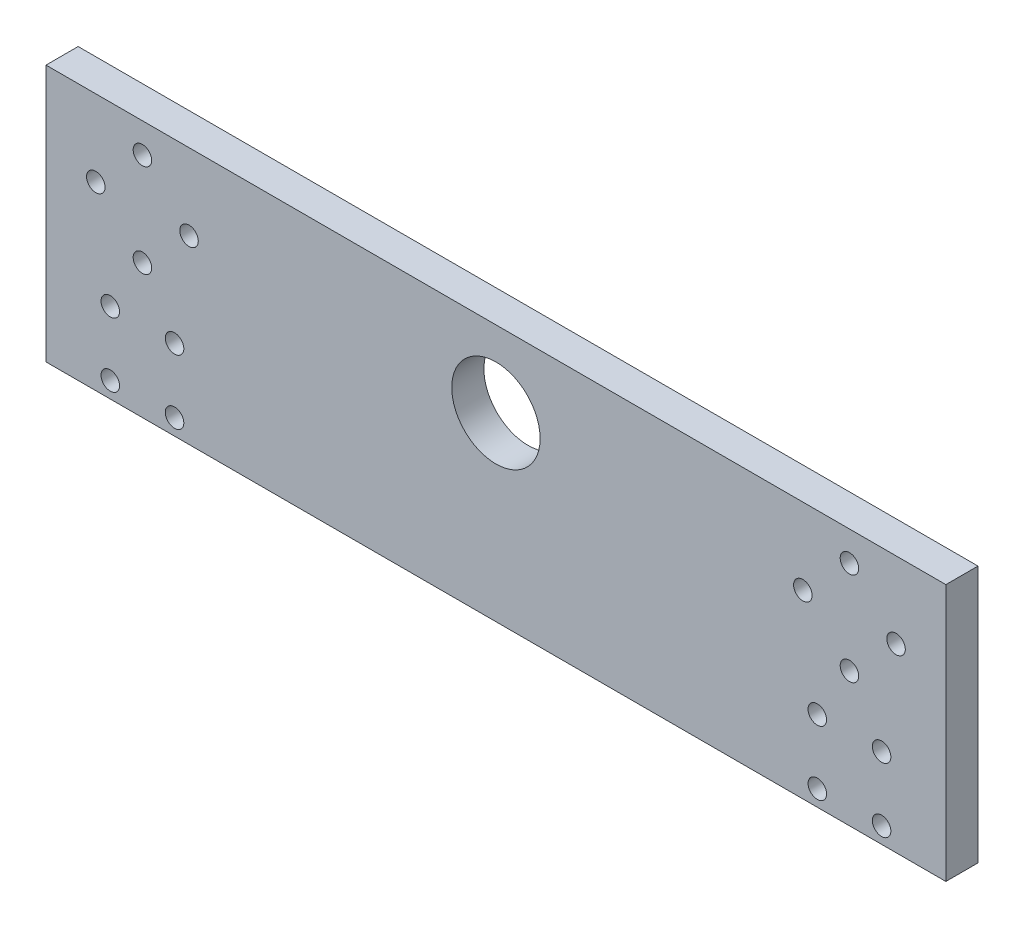
ISO-10303-21;
HEADER;
FILE_DESCRIPTION(('STEP AP214'),'2;1');
FILE_NAME('part.step','',(''),(''),'','','');
FILE_SCHEMA(('AUTOMOTIVE_DESIGN { 1 0 10303 214 1 1 1 1 }'));
ENDSEC;
DATA;
#1=APPLICATION_CONTEXT('core data for automotive mechanical design processes');
#2=APPLICATION_PROTOCOL_DEFINITION('international standard','automotive_design',2000,#1);
#3=PRODUCT_CONTEXT('',#1,'mechanical');
#4=PRODUCT('Part','Part','',(#3));
#5=PRODUCT_RELATED_PRODUCT_CATEGORY('part','',(#4));
#6=PRODUCT_DEFINITION_FORMATION('','',#4);
#7=PRODUCT_DEFINITION_CONTEXT('part definition',#1,'design');
#8=PRODUCT_DEFINITION('design','',#6,#7);
#9=PRODUCT_DEFINITION_SHAPE('','',#8);
#10=(LENGTH_UNIT() NAMED_UNIT(*) SI_UNIT(.MILLI.,.METRE.));
#11=(NAMED_UNIT(*) PLANE_ANGLE_UNIT() SI_UNIT($,.RADIAN.));
#12=(NAMED_UNIT(*) SI_UNIT($,.STERADIAN.) SOLID_ANGLE_UNIT());
#13=UNCERTAINTY_MEASURE_WITH_UNIT(LENGTH_MEASURE(1.E-05),#10,'distance_accuracy_value','');
#14=(GEOMETRIC_REPRESENTATION_CONTEXT(3) GLOBAL_UNCERTAINTY_ASSIGNED_CONTEXT((#13)) GLOBAL_UNIT_ASSIGNED_CONTEXT((#10,
#11,#12)) REPRESENTATION_CONTEXT('',''));
#15=CARTESIAN_POINT('',(0.,0.,0.));
#16=DIRECTION('',(0.,0.,1.));
#17=DIRECTION('',(1.,0.,0.));
#18=AXIS2_PLACEMENT_3D('',#15,#16,#17);
#19=CARTESIAN_POINT('',(0.,0.,6.35));
#20=DIRECTION('',(0.,0.,1.));
#21=DIRECTION('',(1.,0.,0.));
#22=AXIS2_PLACEMENT_3D('',#19,#20,#21);
#23=PLANE('',#22);
#24=CARTESIAN_POINT('',(76.2,-32.54375,6.35));
#25=DIRECTION('',(0.,0.,1.));
#26=DIRECTION('',(1.,0.,0.));
#27=AXIS2_PLACEMENT_3D('',#24,#25,#26);
#28=CIRCLE('',#27,1.8288);
#29=CARTESIAN_POINT('',(78.0288,-32.54375,6.35));
#30=VERTEX_POINT('',#29);
#31=EDGE_CURVE('E198',#30,#30,#28,.T.);
#32=ORIENTED_EDGE('',*,*,#31,.F.);
#33=EDGE_LOOP('',(#32));
#34=FACE_BOUND('',#33,.T.);
#35=CARTESIAN_POINT('',(63.5,-19.84375,6.35));
#36=DIRECTION('',(0.,0.,1.));
#37=DIRECTION('',(1.,0.,0.));
#38=AXIS2_PLACEMENT_3D('',#35,#36,#37);
#39=CIRCLE('',#38,1.8288);
#40=CARTESIAN_POINT('',(65.3288,-19.84375,6.35));
#41=VERTEX_POINT('',#40);
#42=EDGE_CURVE('E186',#41,#41,#39,.T.);
#43=ORIENTED_EDGE('',*,*,#42,.F.);
#44=EDGE_LOOP('',(#43));
#45=FACE_BOUND('',#44,.T.);
#46=CARTESIAN_POINT('',(-63.5,-32.54375,6.35));
#47=DIRECTION('',(0.,0.,1.));
#48=DIRECTION('',(1.,0.,0.));
#49=AXIS2_PLACEMENT_3D('',#46,#47,#48);
#50=CIRCLE('',#49,1.8288);
#51=CARTESIAN_POINT('',(-61.6712,-32.54375,6.35));
#52=VERTEX_POINT('',#51);
#53=EDGE_CURVE('E174',#52,#52,#50,.T.);
#54=ORIENTED_EDGE('',*,*,#53,.F.);
#55=EDGE_LOOP('',(#54));
#56=FACE_BOUND('',#55,.T.);
#57=CARTESIAN_POINT('',(-76.2,-19.84375,6.35));
#58=DIRECTION('',(0.,0.,1.));
#59=DIRECTION('',(1.,0.,0.));
#60=AXIS2_PLACEMENT_3D('',#57,#58,#59);
#61=CIRCLE('',#60,1.8288);
#62=CARTESIAN_POINT('',(-74.3712,-19.84375,6.35));
#63=VERTEX_POINT('',#62);
#64=EDGE_CURVE('E162',#63,#63,#61,.T.);
#65=ORIENTED_EDGE('',*,*,#64,.F.);
#66=EDGE_LOOP('',(#65));
#67=FACE_BOUND('',#66,.T.);
#68=CARTESIAN_POINT('',(-69.85,9.20749999999997,6.35));
#69=DIRECTION('',(0.,0.,1.));
#70=DIRECTION('',(1.,0.,0.));
#71=AXIS2_PLACEMENT_3D('',#68,#69,#70);
#72=CIRCLE('',#71,1.82879999999987);
#73=CARTESIAN_POINT('',(-68.0212000000001,9.20749999999997,6.35));
#74=VERTEX_POINT('',#73);
#75=EDGE_CURVE('E150',#74,#74,#72,.T.);
#76=ORIENTED_EDGE('',*,*,#75,.F.);
#77=EDGE_LOOP('',(#76));
#78=FACE_BOUND('',#77,.T.);
#79=CARTESIAN_POINT('',(79.0575,0.,6.35));
#80=DIRECTION('',(0.,0.,1.));
#81=DIRECTION('',(1.,0.,0.));
#82=AXIS2_PLACEMENT_3D('',#79,#80,#81);
#83=CIRCLE('',#82,1.82879999999998);
#84=CARTESIAN_POINT('',(80.8863,0.,6.35));
#85=VERTEX_POINT('',#84);
#86=EDGE_CURVE('E138',#85,#85,#83,.T.);
#87=ORIENTED_EDGE('',*,*,#86,.F.);
#88=EDGE_LOOP('',(#87));
#89=FACE_BOUND('',#88,.T.);
#90=CARTESIAN_POINT('',(60.6425,0.,6.35));
#91=DIRECTION('',(0.,0.,1.));
#92=DIRECTION('',(1.,0.,0.));
#93=AXIS2_PLACEMENT_3D('',#90,#91,#92);
#94=CIRCLE('',#93,1.8288);
#95=CARTESIAN_POINT('',(62.4713,0.,6.35));
#96=VERTEX_POINT('',#95);
#97=EDGE_CURVE('E126',#96,#96,#94,.T.);
#98=ORIENTED_EDGE('',*,*,#97,.F.);
#99=EDGE_LOOP('',(#98));
#100=FACE_BOUND('',#99,.T.);
#101=CARTESIAN_POINT('',(-79.0575,0.,6.35));
#102=DIRECTION('',(0.,0.,1.));
#103=DIRECTION('',(1.,0.,0.));
#104=AXIS2_PLACEMENT_3D('',#101,#102,#103);
#105=CIRCLE('',#104,1.8288);
#106=CARTESIAN_POINT('',(-77.2287,0.,6.35));
#107=VERTEX_POINT('',#106);
#108=EDGE_CURVE('E114',#107,#107,#105,.T.);
#109=ORIENTED_EDGE('',*,*,#108,.F.);
#110=EDGE_LOOP('',(#109));
#111=FACE_BOUND('',#110,.T.);
#112=DIRECTION('',(0.,-1.,0.));
#113=VECTOR('',#112,1.);
#114=CARTESIAN_POINT('',(-88.9,15.08125,6.35));
#115=LINE('',#114,#113);
#116=CARTESIAN_POINT('',(-88.9,15.08125,6.35));
#117=VERTEX_POINT('',#116);
#118=CARTESIAN_POINT('',(-88.9,-35.71875,6.35));
#119=VERTEX_POINT('',#118);
#120=EDGE_CURVE('E84',#117,#119,#115,.T.);
#121=ORIENTED_EDGE('',*,*,#120,.T.);
#122=DIRECTION('',(1.,0.,0.));
#123=VECTOR('',#122,1.);
#124=CARTESIAN_POINT('',(-88.9,-35.71875,6.35));
#125=LINE('',#124,#123);
#126=CARTESIAN_POINT('',(88.9,-35.71875,6.35));
#127=VERTEX_POINT('',#126);
#128=EDGE_CURVE('E79',#119,#127,#125,.T.);
#129=ORIENTED_EDGE('',*,*,#128,.T.);
#130=DIRECTION('',(0.,1.,0.));
#131=VECTOR('',#130,1.);
#132=CARTESIAN_POINT('',(88.9,15.08125,6.35));
#133=LINE('',#132,#131);
#134=CARTESIAN_POINT('',(88.9,15.08125,6.35));
#135=VERTEX_POINT('',#134);
#136=EDGE_CURVE('E82',#127,#135,#133,.T.);
#137=ORIENTED_EDGE('',*,*,#136,.T.);
#138=DIRECTION('',(-1.,0.,0.));
#139=VECTOR('',#138,1.);
#140=CARTESIAN_POINT('',(-88.9,15.08125,6.35));
#141=LINE('',#140,#139);
#142=EDGE_CURVE('E49',#135,#117,#141,.T.);
#143=ORIENTED_EDGE('',*,*,#142,.T.);
#144=EDGE_LOOP('',(#121,#129,#137,#143));
#145=FACE_BOUND('',#144,.T.);
#146=CARTESIAN_POINT('',(0.,0.,6.35));
#147=DIRECTION('',(0.,0.,1.));
#148=DIRECTION('',(1.,0.,0.));
#149=AXIS2_PLACEMENT_3D('',#146,#147,#148);
#150=CIRCLE('',#149,8.73125);
#151=CARTESIAN_POINT('',(8.73125,0.,6.35));
#152=VERTEX_POINT('',#151);
#153=EDGE_CURVE('E99',#152,#152,#150,.T.);
#154=ORIENTED_EDGE('',*,*,#153,.F.);
#155=EDGE_LOOP('',(#154));
#156=FACE_BOUND('',#155,.T.);
#157=CARTESIAN_POINT('',(-60.6425,0.,6.35));
#158=DIRECTION('',(0.,0.,1.));
#159=DIRECTION('',(1.,0.,0.));
#160=AXIS2_PLACEMENT_3D('',#157,#158,#159);
#161=CIRCLE('',#160,1.82880000000001);
#162=CARTESIAN_POINT('',(-58.8137,0.,6.35));
#163=VERTEX_POINT('',#162);
#164=EDGE_CURVE('E120',#163,#163,#161,.T.);
#165=ORIENTED_EDGE('',*,*,#164,.F.);
#166=EDGE_LOOP('',(#165));
#167=FACE_BOUND('',#166,.T.);
#168=CARTESIAN_POINT('',(69.8499999999999,9.2075,6.35));
#169=DIRECTION('',(0.,0.,1.));
#170=DIRECTION('',(1.,0.,0.));
#171=AXIS2_PLACEMENT_3D('',#168,#169,#170);
#172=CIRCLE('',#171,1.82879999999998);
#173=CARTESIAN_POINT('',(71.6787999999999,9.2075,6.35));
#174=VERTEX_POINT('',#173);
#175=EDGE_CURVE('E132',#174,#174,#172,.T.);
#176=ORIENTED_EDGE('',*,*,#175,.F.);
#177=EDGE_LOOP('',(#176));
#178=FACE_BOUND('',#177,.T.);
#179=CARTESIAN_POINT('',(69.85,-9.2075,6.35));
#180=DIRECTION('',(0.,0.,1.));
#181=DIRECTION('',(1.,0.,0.));
#182=AXIS2_PLACEMENT_3D('',#179,#180,#181);
#183=CIRCLE('',#182,1.82879999999998);
#184=CARTESIAN_POINT('',(71.6788,-9.2075,6.35));
#185=VERTEX_POINT('',#184);
#186=EDGE_CURVE('E144',#185,#185,#183,.T.);
#187=ORIENTED_EDGE('',*,*,#186,.F.);
#188=EDGE_LOOP('',(#187));
#189=FACE_BOUND('',#188,.T.);
#190=CARTESIAN_POINT('',(-69.85,-9.20750000000004,6.35));
#191=DIRECTION('',(0.,0.,1.));
#192=DIRECTION('',(1.,0.,0.));
#193=AXIS2_PLACEMENT_3D('',#190,#191,#192);
#194=CIRCLE('',#193,1.82880000000006);
#195=CARTESIAN_POINT('',(-68.0212,-9.20750000000004,6.35));
#196=VERTEX_POINT('',#195);
#197=EDGE_CURVE('E156',#196,#196,#194,.T.);
#198=ORIENTED_EDGE('',*,*,#197,.F.);
#199=EDGE_LOOP('',(#198));
#200=FACE_BOUND('',#199,.T.);
#201=CARTESIAN_POINT('',(-63.5,-19.84375,6.35));
#202=DIRECTION('',(0.,0.,1.));
#203=DIRECTION('',(1.,0.,0.));
#204=AXIS2_PLACEMENT_3D('',#201,#202,#203);
#205=CIRCLE('',#204,1.8288);
#206=CARTESIAN_POINT('',(-61.6712,-19.84375,6.35));
#207=VERTEX_POINT('',#206);
#208=EDGE_CURVE('E168',#207,#207,#205,.T.);
#209=ORIENTED_EDGE('',*,*,#208,.F.);
#210=EDGE_LOOP('',(#209));
#211=FACE_BOUND('',#210,.T.);
#212=CARTESIAN_POINT('',(-76.2,-32.54375,6.35));
#213=DIRECTION('',(0.,0.,1.));
#214=DIRECTION('',(1.,0.,0.));
#215=AXIS2_PLACEMENT_3D('',#212,#213,#214);
#216=CIRCLE('',#215,1.8288);
#217=CARTESIAN_POINT('',(-74.3712,-32.54375,6.35));
#218=VERTEX_POINT('',#217);
#219=EDGE_CURVE('E180',#218,#218,#216,.T.);
#220=ORIENTED_EDGE('',*,*,#219,.F.);
#221=EDGE_LOOP('',(#220));
#222=FACE_BOUND('',#221,.T.);
#223=CARTESIAN_POINT('',(76.2,-19.84375,6.35));
#224=DIRECTION('',(0.,0.,1.));
#225=DIRECTION('',(1.,0.,0.));
#226=AXIS2_PLACEMENT_3D('',#223,#224,#225);
#227=CIRCLE('',#226,1.8288);
#228=CARTESIAN_POINT('',(78.0288,-19.84375,6.35));
#229=VERTEX_POINT('',#228);
#230=EDGE_CURVE('E192',#229,#229,#227,.T.);
#231=ORIENTED_EDGE('',*,*,#230,.F.);
#232=EDGE_LOOP('',(#231));
#233=FACE_BOUND('',#232,.T.);
#234=CARTESIAN_POINT('',(63.5,-32.54375,6.35));
#235=DIRECTION('',(0.,0.,1.));
#236=DIRECTION('',(1.,0.,0.));
#237=AXIS2_PLACEMENT_3D('',#234,#235,#236);
#238=CIRCLE('',#237,1.8288);
#239=CARTESIAN_POINT('',(65.3288,-32.54375,6.35));
#240=VERTEX_POINT('',#239);
#241=EDGE_CURVE('E204',#240,#240,#238,.T.);
#242=ORIENTED_EDGE('',*,*,#241,.F.);
#243=EDGE_LOOP('',(#242));
#244=FACE_BOUND('',#243,.T.);
#245=ADVANCED_FACE('F32',(#34,#45,#56,#67,#78,#89,#100,#111,#145,#156,#167,#178,#189,#200,#211,
#222,#233,#244),#23,.T.);
#246=CARTESIAN_POINT('',(0.,0.,0.));
#247=DIRECTION('',(0.,0.,1.));
#248=DIRECTION('',(1.,0.,0.));
#249=AXIS2_PLACEMENT_3D('',#246,#247,#248);
#250=PLANE('',#249);
#251=DIRECTION('',(0.,-1.,0.));
#252=VECTOR('',#251,1.);
#253=CARTESIAN_POINT('',(-88.9,15.08125,0.));
#254=LINE('',#253,#252);
#255=CARTESIAN_POINT('',(-88.9,15.08125,0.));
#256=VERTEX_POINT('',#255);
#257=CARTESIAN_POINT('',(-88.9,-35.71875,0.));
#258=VERTEX_POINT('',#257);
#259=EDGE_CURVE('E96',#256,#258,#254,.T.);
#260=ORIENTED_EDGE('',*,*,#259,.F.);
#261=DIRECTION('',(-1.,0.,0.));
#262=VECTOR('',#261,1.);
#263=CARTESIAN_POINT('',(-88.9,15.08125,0.));
#264=LINE('',#263,#262);
#265=CARTESIAN_POINT('',(88.9,15.08125,0.));
#266=VERTEX_POINT('',#265);
#267=EDGE_CURVE('E72',#266,#256,#264,.T.);
#268=ORIENTED_EDGE('',*,*,#267,.F.);
#269=DIRECTION('',(0.,1.,0.));
#270=VECTOR('',#269,1.);
#271=CARTESIAN_POINT('',(88.9,15.08125,0.));
#272=LINE('',#271,#270);
#273=CARTESIAN_POINT('',(88.9,-35.71875,0.));
#274=VERTEX_POINT('',#273);
#275=EDGE_CURVE('E66',#274,#266,#272,.T.);
#276=ORIENTED_EDGE('',*,*,#275,.F.);
#277=DIRECTION('',(1.,0.,0.));
#278=VECTOR('',#277,1.);
#279=CARTESIAN_POINT('',(-88.9,-35.71875,0.));
#280=LINE('',#279,#278);
#281=EDGE_CURVE('E88',#258,#274,#280,.T.);
#282=ORIENTED_EDGE('',*,*,#281,.F.);
#283=EDGE_LOOP('',(#260,#268,#276,#282));
#284=FACE_BOUND('',#283,.T.);
#285=CARTESIAN_POINT('',(0.,0.,0.));
#286=DIRECTION('',(0.,0.,1.));
#287=DIRECTION('',(1.,0.,0.));
#288=AXIS2_PLACEMENT_3D('',#285,#286,#287);
#289=CIRCLE('',#288,8.73125);
#290=CARTESIAN_POINT('',(8.73125,0.,0.));
#291=VERTEX_POINT('',#290);
#292=EDGE_CURVE('E111',#291,#291,#289,.T.);
#293=ORIENTED_EDGE('',*,*,#292,.T.);
#294=EDGE_LOOP('',(#293));
#295=FACE_BOUND('',#294,.T.);
#296=CARTESIAN_POINT('',(-79.0575,0.,0.));
#297=DIRECTION('',(0.,0.,1.));
#298=DIRECTION('',(1.,0.,0.));
#299=AXIS2_PLACEMENT_3D('',#296,#297,#298);
#300=CIRCLE('',#299,1.8288);
#301=CARTESIAN_POINT('',(-77.2287,0.,0.));
#302=VERTEX_POINT('',#301);
#303=EDGE_CURVE('E117',#302,#302,#300,.T.);
#304=ORIENTED_EDGE('',*,*,#303,.T.);
#305=EDGE_LOOP('',(#304));
#306=FACE_BOUND('',#305,.T.);
#307=CARTESIAN_POINT('',(-60.6425,0.,0.));
#308=DIRECTION('',(0.,0.,1.));
#309=DIRECTION('',(1.,0.,0.));
#310=AXIS2_PLACEMENT_3D('',#307,#308,#309);
#311=CIRCLE('',#310,1.82880000000001);
#312=CARTESIAN_POINT('',(-58.8137,0.,0.));
#313=VERTEX_POINT('',#312);
#314=EDGE_CURVE('E123',#313,#313,#311,.T.);
#315=ORIENTED_EDGE('',*,*,#314,.T.);
#316=EDGE_LOOP('',(#315));
#317=FACE_BOUND('',#316,.T.);
#318=CARTESIAN_POINT('',(60.6425,0.,0.));
#319=DIRECTION('',(0.,0.,1.));
#320=DIRECTION('',(1.,0.,0.));
#321=AXIS2_PLACEMENT_3D('',#318,#319,#320);
#322=CIRCLE('',#321,1.8288);
#323=CARTESIAN_POINT('',(62.4713,0.,0.));
#324=VERTEX_POINT('',#323);
#325=EDGE_CURVE('E129',#324,#324,#322,.T.);
#326=ORIENTED_EDGE('',*,*,#325,.T.);
#327=EDGE_LOOP('',(#326));
#328=FACE_BOUND('',#327,.T.);
#329=CARTESIAN_POINT('',(69.8499999999999,9.2075,0.));
#330=DIRECTION('',(0.,0.,1.));
#331=DIRECTION('',(1.,0.,0.));
#332=AXIS2_PLACEMENT_3D('',#329,#330,#331);
#333=CIRCLE('',#332,1.82879999999998);
#334=CARTESIAN_POINT('',(71.6787999999999,9.2075,0.));
#335=VERTEX_POINT('',#334);
#336=EDGE_CURVE('E135',#335,#335,#333,.T.);
#337=ORIENTED_EDGE('',*,*,#336,.T.);
#338=EDGE_LOOP('',(#337));
#339=FACE_BOUND('',#338,.T.);
#340=CARTESIAN_POINT('',(79.0575,0.,0.));
#341=DIRECTION('',(0.,0.,1.));
#342=DIRECTION('',(1.,0.,0.));
#343=AXIS2_PLACEMENT_3D('',#340,#341,#342);
#344=CIRCLE('',#343,1.82879999999998);
#345=CARTESIAN_POINT('',(80.8863,0.,0.));
#346=VERTEX_POINT('',#345);
#347=EDGE_CURVE('E141',#346,#346,#344,.T.);
#348=ORIENTED_EDGE('',*,*,#347,.T.);
#349=EDGE_LOOP('',(#348));
#350=FACE_BOUND('',#349,.T.);
#351=CARTESIAN_POINT('',(69.85,-9.2075,0.));
#352=DIRECTION('',(0.,0.,1.));
#353=DIRECTION('',(1.,0.,0.));
#354=AXIS2_PLACEMENT_3D('',#351,#352,#353);
#355=CIRCLE('',#354,1.82879999999998);
#356=CARTESIAN_POINT('',(71.6788,-9.2075,0.));
#357=VERTEX_POINT('',#356);
#358=EDGE_CURVE('E147',#357,#357,#355,.T.);
#359=ORIENTED_EDGE('',*,*,#358,.T.);
#360=EDGE_LOOP('',(#359));
#361=FACE_BOUND('',#360,.T.);
#362=CARTESIAN_POINT('',(-69.85,9.20749999999997,0.));
#363=DIRECTION('',(0.,0.,1.));
#364=DIRECTION('',(1.,0.,0.));
#365=AXIS2_PLACEMENT_3D('',#362,#363,#364);
#366=CIRCLE('',#365,1.82879999999987);
#367=CARTESIAN_POINT('',(-68.0212000000001,9.20749999999997,0.));
#368=VERTEX_POINT('',#367);
#369=EDGE_CURVE('E153',#368,#368,#366,.T.);
#370=ORIENTED_EDGE('',*,*,#369,.T.);
#371=EDGE_LOOP('',(#370));
#372=FACE_BOUND('',#371,.T.);
#373=CARTESIAN_POINT('',(-69.85,-9.20750000000004,0.));
#374=DIRECTION('',(0.,0.,1.));
#375=DIRECTION('',(1.,0.,0.));
#376=AXIS2_PLACEMENT_3D('',#373,#374,#375);
#377=CIRCLE('',#376,1.82880000000006);
#378=CARTESIAN_POINT('',(-68.0212,-9.20750000000004,0.));
#379=VERTEX_POINT('',#378);
#380=EDGE_CURVE('E159',#379,#379,#377,.T.);
#381=ORIENTED_EDGE('',*,*,#380,.T.);
#382=EDGE_LOOP('',(#381));
#383=FACE_BOUND('',#382,.T.);
#384=CARTESIAN_POINT('',(-76.2,-19.84375,0.));
#385=DIRECTION('',(0.,0.,1.));
#386=DIRECTION('',(1.,0.,0.));
#387=AXIS2_PLACEMENT_3D('',#384,#385,#386);
#388=CIRCLE('',#387,1.8288);
#389=CARTESIAN_POINT('',(-74.3712,-19.84375,0.));
#390=VERTEX_POINT('',#389);
#391=EDGE_CURVE('E165',#390,#390,#388,.T.);
#392=ORIENTED_EDGE('',*,*,#391,.T.);
#393=EDGE_LOOP('',(#392));
#394=FACE_BOUND('',#393,.T.);
#395=CARTESIAN_POINT('',(-63.5,-19.84375,0.));
#396=DIRECTION('',(0.,0.,1.));
#397=DIRECTION('',(1.,0.,0.));
#398=AXIS2_PLACEMENT_3D('',#395,#396,#397);
#399=CIRCLE('',#398,1.8288);
#400=CARTESIAN_POINT('',(-61.6712,-19.84375,0.));
#401=VERTEX_POINT('',#400);
#402=EDGE_CURVE('E171',#401,#401,#399,.T.);
#403=ORIENTED_EDGE('',*,*,#402,.T.);
#404=EDGE_LOOP('',(#403));
#405=FACE_BOUND('',#404,.T.);
#406=CARTESIAN_POINT('',(-63.5,-32.54375,0.));
#407=DIRECTION('',(0.,0.,1.));
#408=DIRECTION('',(1.,0.,0.));
#409=AXIS2_PLACEMENT_3D('',#406,#407,#408);
#410=CIRCLE('',#409,1.8288);
#411=CARTESIAN_POINT('',(-61.6712,-32.54375,0.));
#412=VERTEX_POINT('',#411);
#413=EDGE_CURVE('E177',#412,#412,#410,.T.);
#414=ORIENTED_EDGE('',*,*,#413,.T.);
#415=EDGE_LOOP('',(#414));
#416=FACE_BOUND('',#415,.T.);
#417=CARTESIAN_POINT('',(-76.2,-32.54375,0.));
#418=DIRECTION('',(0.,0.,1.));
#419=DIRECTION('',(1.,0.,0.));
#420=AXIS2_PLACEMENT_3D('',#417,#418,#419);
#421=CIRCLE('',#420,1.8288);
#422=CARTESIAN_POINT('',(-74.3712,-32.54375,0.));
#423=VERTEX_POINT('',#422);
#424=EDGE_CURVE('E183',#423,#423,#421,.T.);
#425=ORIENTED_EDGE('',*,*,#424,.T.);
#426=EDGE_LOOP('',(#425));
#427=FACE_BOUND('',#426,.T.);
#428=CARTESIAN_POINT('',(63.5,-19.84375,0.));
#429=DIRECTION('',(0.,0.,1.));
#430=DIRECTION('',(1.,0.,0.));
#431=AXIS2_PLACEMENT_3D('',#428,#429,#430);
#432=CIRCLE('',#431,1.8288);
#433=CARTESIAN_POINT('',(65.3288,-19.84375,0.));
#434=VERTEX_POINT('',#433);
#435=EDGE_CURVE('E189',#434,#434,#432,.T.);
#436=ORIENTED_EDGE('',*,*,#435,.T.);
#437=EDGE_LOOP('',(#436));
#438=FACE_BOUND('',#437,.T.);
#439=CARTESIAN_POINT('',(76.2,-19.84375,0.));
#440=DIRECTION('',(0.,0.,1.));
#441=DIRECTION('',(1.,0.,0.));
#442=AXIS2_PLACEMENT_3D('',#439,#440,#441);
#443=CIRCLE('',#442,1.8288);
#444=CARTESIAN_POINT('',(78.0288,-19.84375,0.));
#445=VERTEX_POINT('',#444);
#446=EDGE_CURVE('E195',#445,#445,#443,.T.);
#447=ORIENTED_EDGE('',*,*,#446,.T.);
#448=EDGE_LOOP('',(#447));
#449=FACE_BOUND('',#448,.T.);
#450=CARTESIAN_POINT('',(76.2,-32.54375,0.));
#451=DIRECTION('',(0.,0.,1.));
#452=DIRECTION('',(1.,0.,0.));
#453=AXIS2_PLACEMENT_3D('',#450,#451,#452);
#454=CIRCLE('',#453,1.8288);
#455=CARTESIAN_POINT('',(78.0288,-32.54375,0.));
#456=VERTEX_POINT('',#455);
#457=EDGE_CURVE('E201',#456,#456,#454,.T.);
#458=ORIENTED_EDGE('',*,*,#457,.T.);
#459=EDGE_LOOP('',(#458));
#460=FACE_BOUND('',#459,.T.);
#461=CARTESIAN_POINT('',(63.5,-32.54375,0.));
#462=DIRECTION('',(0.,0.,1.));
#463=DIRECTION('',(1.,0.,0.));
#464=AXIS2_PLACEMENT_3D('',#461,#462,#463);
#465=CIRCLE('',#464,1.8288);
#466=CARTESIAN_POINT('',(65.3288,-32.54375,0.));
#467=VERTEX_POINT('',#466);
#468=EDGE_CURVE('E207',#467,#467,#465,.T.);
#469=ORIENTED_EDGE('',*,*,#468,.T.);
#470=EDGE_LOOP('',(#469));
#471=FACE_BOUND('',#470,.T.);
#472=ADVANCED_FACE('F107',(#284,#295,#306,#317,#328,#339,#350,#361,#372,#383,#394,#405,#416,
#427,#438,#449,#460,#471),#250,.F.);
#473=CARTESIAN_POINT('',(-88.9,15.08125,6.35));
#474=DIRECTION('',(1.,0.,0.));
#475=DIRECTION('',(0.,0.,-1.));
#476=AXIS2_PLACEMENT_3D('',#473,#474,#475);
#477=PLANE('',#476);
#478=ORIENTED_EDGE('',*,*,#259,.T.);
#479=DIRECTION('',(0.,0.,-1.));
#480=VECTOR('',#479,1.);
#481=CARTESIAN_POINT('',(-88.9,-35.71875,6.35));
#482=LINE('',#481,#480);
#483=EDGE_CURVE('E11',#119,#258,#482,.T.);
#484=ORIENTED_EDGE('',*,*,#483,.F.);
#485=ORIENTED_EDGE('',*,*,#120,.F.);
#486=DIRECTION('',(0.,0.,-1.));
#487=VECTOR('',#486,1.);
#488=CARTESIAN_POINT('',(-88.9,15.08125,6.35));
#489=LINE('',#488,#487);
#490=EDGE_CURVE('E92',#117,#256,#489,.T.);
#491=ORIENTED_EDGE('',*,*,#490,.T.);
#492=EDGE_LOOP('',(#478,#484,#485,#491));
#493=FACE_BOUND('',#492,.T.);
#494=ADVANCED_FACE('F34',(#493),#477,.F.);
#495=CARTESIAN_POINT('',(-88.9,-35.71875,6.35));
#496=DIRECTION('',(0.,1.,0.));
#497=DIRECTION('',(0.,0.,1.));
#498=AXIS2_PLACEMENT_3D('',#495,#496,#497);
#499=PLANE('',#498);
#500=ORIENTED_EDGE('',*,*,#281,.T.);
#501=DIRECTION('',(0.,0.,-1.));
#502=VECTOR('',#501,1.);
#503=CARTESIAN_POINT('',(88.9,-35.71875,6.35));
#504=LINE('',#503,#502);
#505=EDGE_CURVE('E41',#127,#274,#504,.T.);
#506=ORIENTED_EDGE('',*,*,#505,.F.);
#507=ORIENTED_EDGE('',*,*,#128,.F.);
#508=ORIENTED_EDGE('',*,*,#483,.T.);
#509=EDGE_LOOP('',(#500,#506,#507,#508));
#510=FACE_BOUND('',#509,.T.);
#511=ADVANCED_FACE('F87',(#510),#499,.F.);
#512=CARTESIAN_POINT('',(88.9,15.08125,6.35));
#513=DIRECTION('',(-1.,0.,0.));
#514=DIRECTION('',(0.,-1.,0.));
#515=AXIS2_PLACEMENT_3D('',#512,#513,#514);
#516=PLANE('',#515);
#517=ORIENTED_EDGE('',*,*,#275,.T.);
#518=DIRECTION('',(0.,0.,-1.));
#519=VECTOR('',#518,1.);
#520=CARTESIAN_POINT('',(88.9,15.08125,6.35));
#521=LINE('',#520,#519);
#522=EDGE_CURVE('E89',#135,#266,#521,.T.);
#523=ORIENTED_EDGE('',*,*,#522,.F.);
#524=ORIENTED_EDGE('',*,*,#136,.F.);
#525=ORIENTED_EDGE('',*,*,#505,.T.);
#526=EDGE_LOOP('',(#517,#523,#524,#525));
#527=FACE_BOUND('',#526,.T.);
#528=ADVANCED_FACE('F90',(#527),#516,.F.);
#529=CARTESIAN_POINT('',(-88.9,15.08125,6.35));
#530=DIRECTION('',(0.,-1.,0.));
#531=DIRECTION('',(0.,0.,-1.));
#532=AXIS2_PLACEMENT_3D('',#529,#530,#531);
#533=PLANE('',#532);
#534=ORIENTED_EDGE('',*,*,#267,.T.);
#535=ORIENTED_EDGE('',*,*,#490,.F.);
#536=ORIENTED_EDGE('',*,*,#142,.F.);
#537=ORIENTED_EDGE('',*,*,#522,.T.);
#538=EDGE_LOOP('',(#534,#535,#536,#537));
#539=FACE_BOUND('',#538,.T.);
#540=ADVANCED_FACE('F104',(#539),#533,.F.);
#541=CARTESIAN_POINT('',(0.,0.,6.35));
#542=DIRECTION('',(0.,0.,-1.));
#543=DIRECTION('',(-1.,0.,0.));
#544=AXIS2_PLACEMENT_3D('',#541,#542,#543);
#545=CYLINDRICAL_SURFACE('',#544,8.73125);
#546=ORIENTED_EDGE('',*,*,#153,.T.);
#547=EDGE_LOOP('',(#546));
#548=FACE_BOUND('',#547,.T.);
#549=ORIENTED_EDGE('',*,*,#292,.F.);
#550=EDGE_LOOP('',(#549));
#551=FACE_BOUND('',#550,.T.);
#552=ADVANCED_FACE('F226',(#548,#551),#545,.F.);
#553=CARTESIAN_POINT('',(-79.0575,0.,6.35));
#554=DIRECTION('',(0.,0.,-1.));
#555=DIRECTION('',(-1.,0.,0.));
#556=AXIS2_PLACEMENT_3D('',#553,#554,#555);
#557=CYLINDRICAL_SURFACE('',#556,1.8288);
#558=ORIENTED_EDGE('',*,*,#108,.T.);
#559=EDGE_LOOP('',(#558));
#560=FACE_BOUND('',#559,.T.);
#561=ORIENTED_EDGE('',*,*,#303,.F.);
#562=EDGE_LOOP('',(#561));
#563=FACE_BOUND('',#562,.T.);
#564=ADVANCED_FACE('F272',(#560,#563),#557,.F.);
#565=CARTESIAN_POINT('',(-60.6425,0.,6.35));
#566=DIRECTION('',(0.,0.,-1.));
#567=DIRECTION('',(-1.,0.,0.));
#568=AXIS2_PLACEMENT_3D('',#565,#566,#567);
#569=CYLINDRICAL_SURFACE('',#568,1.82880000000001);
#570=ORIENTED_EDGE('',*,*,#164,.T.);
#571=EDGE_LOOP('',(#570));
#572=FACE_BOUND('',#571,.T.);
#573=ORIENTED_EDGE('',*,*,#314,.F.);
#574=EDGE_LOOP('',(#573));
#575=FACE_BOUND('',#574,.T.);
#576=ADVANCED_FACE('F280',(#572,#575),#569,.F.);
#577=CARTESIAN_POINT('',(60.6425,0.,6.35));
#578=DIRECTION('',(0.,0.,-1.));
#579=DIRECTION('',(-1.,0.,0.));
#580=AXIS2_PLACEMENT_3D('',#577,#578,#579);
#581=CYLINDRICAL_SURFACE('',#580,1.8288);
#582=ORIENTED_EDGE('',*,*,#97,.T.);
#583=EDGE_LOOP('',(#582));
#584=FACE_BOUND('',#583,.T.);
#585=ORIENTED_EDGE('',*,*,#325,.F.);
#586=EDGE_LOOP('',(#585));
#587=FACE_BOUND('',#586,.T.);
#588=ADVANCED_FACE('F288',(#584,#587),#581,.F.);
#589=CARTESIAN_POINT('',(69.8499999999999,9.2075,6.35));
#590=DIRECTION('',(0.,0.,-1.));
#591=DIRECTION('',(-1.,0.,0.));
#592=AXIS2_PLACEMENT_3D('',#589,#590,#591);
#593=CYLINDRICAL_SURFACE('',#592,1.82879999999998);
#594=ORIENTED_EDGE('',*,*,#175,.T.);
#595=EDGE_LOOP('',(#594));
#596=FACE_BOUND('',#595,.T.);
#597=ORIENTED_EDGE('',*,*,#336,.F.);
#598=EDGE_LOOP('',(#597));
#599=FACE_BOUND('',#598,.T.);
#600=ADVANCED_FACE('F297',(#596,#599),#593,.F.);
#601=CARTESIAN_POINT('',(79.0575,0.,6.35));
#602=DIRECTION('',(0.,0.,-1.));
#603=DIRECTION('',(-1.,0.,0.));
#604=AXIS2_PLACEMENT_3D('',#601,#602,#603);
#605=CYLINDRICAL_SURFACE('',#604,1.82879999999998);
#606=ORIENTED_EDGE('',*,*,#86,.T.);
#607=EDGE_LOOP('',(#606));
#608=FACE_BOUND('',#607,.T.);
#609=ORIENTED_EDGE('',*,*,#347,.F.);
#610=EDGE_LOOP('',(#609));
#611=FACE_BOUND('',#610,.T.);
#612=ADVANCED_FACE('F306',(#608,#611),#605,.F.);
#613=CARTESIAN_POINT('',(69.85,-9.2075,6.35));
#614=DIRECTION('',(0.,0.,-1.));
#615=DIRECTION('',(-1.,0.,0.));
#616=AXIS2_PLACEMENT_3D('',#613,#614,#615);
#617=CYLINDRICAL_SURFACE('',#616,1.82879999999998);
#618=ORIENTED_EDGE('',*,*,#186,.T.);
#619=EDGE_LOOP('',(#618));
#620=FACE_BOUND('',#619,.T.);
#621=ORIENTED_EDGE('',*,*,#358,.F.);
#622=EDGE_LOOP('',(#621));
#623=FACE_BOUND('',#622,.T.);
#624=ADVANCED_FACE('F315',(#620,#623),#617,.F.);
#625=CARTESIAN_POINT('',(-69.85,9.20749999999997,6.35));
#626=DIRECTION('',(0.,0.,-1.));
#627=DIRECTION('',(-1.,0.,0.));
#628=AXIS2_PLACEMENT_3D('',#625,#626,#627);
#629=CYLINDRICAL_SURFACE('',#628,1.82879999999987);
#630=ORIENTED_EDGE('',*,*,#75,.T.);
#631=EDGE_LOOP('',(#630));
#632=FACE_BOUND('',#631,.T.);
#633=ORIENTED_EDGE('',*,*,#369,.F.);
#634=EDGE_LOOP('',(#633));
#635=FACE_BOUND('',#634,.T.);
#636=ADVANCED_FACE('F324',(#632,#635),#629,.F.);
#637=CARTESIAN_POINT('',(-69.85,-9.20750000000004,6.35));
#638=DIRECTION('',(0.,0.,-1.));
#639=DIRECTION('',(-1.,0.,0.));
#640=AXIS2_PLACEMENT_3D('',#637,#638,#639);
#641=CYLINDRICAL_SURFACE('',#640,1.82880000000006);
#642=ORIENTED_EDGE('',*,*,#197,.T.);
#643=EDGE_LOOP('',(#642));
#644=FACE_BOUND('',#643,.T.);
#645=ORIENTED_EDGE('',*,*,#380,.F.);
#646=EDGE_LOOP('',(#645));
#647=FACE_BOUND('',#646,.T.);
#648=ADVANCED_FACE('F333',(#644,#647),#641,.F.);
#649=CARTESIAN_POINT('',(-76.2,-19.84375,6.35));
#650=DIRECTION('',(0.,0.,-1.));
#651=DIRECTION('',(-1.,0.,0.));
#652=AXIS2_PLACEMENT_3D('',#649,#650,#651);
#653=CYLINDRICAL_SURFACE('',#652,1.8288);
#654=ORIENTED_EDGE('',*,*,#64,.T.);
#655=EDGE_LOOP('',(#654));
#656=FACE_BOUND('',#655,.T.);
#657=ORIENTED_EDGE('',*,*,#391,.F.);
#658=EDGE_LOOP('',(#657));
#659=FACE_BOUND('',#658,.T.);
#660=ADVANCED_FACE('F342',(#656,#659),#653,.F.);
#661=CARTESIAN_POINT('',(-63.5,-19.84375,6.35));
#662=DIRECTION('',(0.,0.,-1.));
#663=DIRECTION('',(-1.,0.,0.));
#664=AXIS2_PLACEMENT_3D('',#661,#662,#663);
#665=CYLINDRICAL_SURFACE('',#664,1.8288);
#666=ORIENTED_EDGE('',*,*,#208,.T.);
#667=EDGE_LOOP('',(#666));
#668=FACE_BOUND('',#667,.T.);
#669=ORIENTED_EDGE('',*,*,#402,.F.);
#670=EDGE_LOOP('',(#669));
#671=FACE_BOUND('',#670,.T.);
#672=ADVANCED_FACE('F351',(#668,#671),#665,.F.);
#673=CARTESIAN_POINT('',(-63.5,-32.54375,6.35));
#674=DIRECTION('',(0.,0.,-1.));
#675=DIRECTION('',(-1.,0.,0.));
#676=AXIS2_PLACEMENT_3D('',#673,#674,#675);
#677=CYLINDRICAL_SURFACE('',#676,1.8288);
#678=ORIENTED_EDGE('',*,*,#53,.T.);
#679=EDGE_LOOP('',(#678));
#680=FACE_BOUND('',#679,.T.);
#681=ORIENTED_EDGE('',*,*,#413,.F.);
#682=EDGE_LOOP('',(#681));
#683=FACE_BOUND('',#682,.T.);
#684=ADVANCED_FACE('F360',(#680,#683),#677,.F.);
#685=CARTESIAN_POINT('',(-76.2,-32.54375,6.35));
#686=DIRECTION('',(0.,0.,-1.));
#687=DIRECTION('',(-1.,0.,0.));
#688=AXIS2_PLACEMENT_3D('',#685,#686,#687);
#689=CYLINDRICAL_SURFACE('',#688,1.8288);
#690=ORIENTED_EDGE('',*,*,#219,.T.);
#691=EDGE_LOOP('',(#690));
#692=FACE_BOUND('',#691,.T.);
#693=ORIENTED_EDGE('',*,*,#424,.F.);
#694=EDGE_LOOP('',(#693));
#695=FACE_BOUND('',#694,.T.);
#696=ADVANCED_FACE('F369',(#692,#695),#689,.F.);
#697=CARTESIAN_POINT('',(63.5,-19.84375,6.35));
#698=DIRECTION('',(0.,0.,-1.));
#699=DIRECTION('',(-1.,0.,0.));
#700=AXIS2_PLACEMENT_3D('',#697,#698,#699);
#701=CYLINDRICAL_SURFACE('',#700,1.8288);
#702=ORIENTED_EDGE('',*,*,#42,.T.);
#703=EDGE_LOOP('',(#702));
#704=FACE_BOUND('',#703,.T.);
#705=ORIENTED_EDGE('',*,*,#435,.F.);
#706=EDGE_LOOP('',(#705));
#707=FACE_BOUND('',#706,.T.);
#708=ADVANCED_FACE('F378',(#704,#707),#701,.F.);
#709=CARTESIAN_POINT('',(76.2,-19.84375,6.35));
#710=DIRECTION('',(0.,0.,-1.));
#711=DIRECTION('',(-1.,0.,0.));
#712=AXIS2_PLACEMENT_3D('',#709,#710,#711);
#713=CYLINDRICAL_SURFACE('',#712,1.8288);
#714=ORIENTED_EDGE('',*,*,#230,.T.);
#715=EDGE_LOOP('',(#714));
#716=FACE_BOUND('',#715,.T.);
#717=ORIENTED_EDGE('',*,*,#446,.F.);
#718=EDGE_LOOP('',(#717));
#719=FACE_BOUND('',#718,.T.);
#720=ADVANCED_FACE('F387',(#716,#719),#713,.F.);
#721=CARTESIAN_POINT('',(76.2,-32.54375,6.35));
#722=DIRECTION('',(0.,0.,-1.));
#723=DIRECTION('',(-1.,0.,0.));
#724=AXIS2_PLACEMENT_3D('',#721,#722,#723);
#725=CYLINDRICAL_SURFACE('',#724,1.8288);
#726=ORIENTED_EDGE('',*,*,#31,.T.);
#727=EDGE_LOOP('',(#726));
#728=FACE_BOUND('',#727,.T.);
#729=ORIENTED_EDGE('',*,*,#457,.F.);
#730=EDGE_LOOP('',(#729));
#731=FACE_BOUND('',#730,.T.);
#732=ADVANCED_FACE('F396',(#728,#731),#725,.F.);
#733=CARTESIAN_POINT('',(63.5,-32.54375,6.35));
#734=DIRECTION('',(0.,0.,-1.));
#735=DIRECTION('',(-1.,0.,0.));
#736=AXIS2_PLACEMENT_3D('',#733,#734,#735);
#737=CYLINDRICAL_SURFACE('',#736,1.8288);
#738=ORIENTED_EDGE('',*,*,#241,.T.);
#739=EDGE_LOOP('',(#738));
#740=FACE_BOUND('',#739,.T.);
#741=ORIENTED_EDGE('',*,*,#468,.F.);
#742=EDGE_LOOP('',(#741));
#743=FACE_BOUND('',#742,.T.);
#744=ADVANCED_FACE('F213',(#740,#743),#737,.F.);
#745=CLOSED_SHELL('',(#245,#472,#494,#511,#528,#540,#552,#564,#576,#588,#600,#612,#624,#636,
#648,#660,#672,#684,#696,#708,#720,#732,#744));
#746=MANIFOLD_SOLID_BREP('B2',#745);
#747=ADVANCED_BREP_SHAPE_REPRESENTATION('',(#18,#746),#14);
#748=SHAPE_DEFINITION_REPRESENTATION(#9,#747);
ENDSEC;
END-ISO-10303-21;
